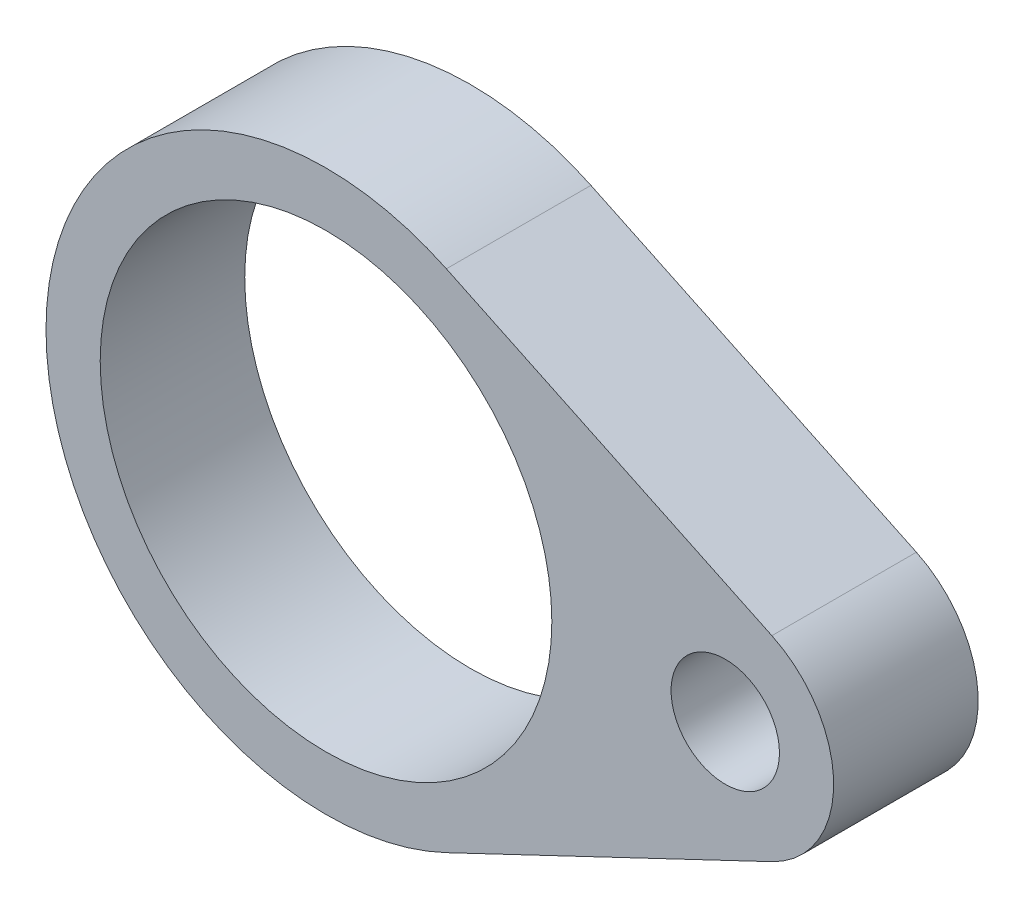
ISO-10303-21;
HEADER;
FILE_DESCRIPTION(('STEP AP214'),'2;1');
FILE_NAME('part.step','',(''),(''),'','','');
FILE_SCHEMA(('AUTOMOTIVE_DESIGN { 1 0 10303 214 1 1 1 1 }'));
ENDSEC;
DATA;
#1=APPLICATION_CONTEXT('core data for automotive mechanical design processes');
#2=APPLICATION_PROTOCOL_DEFINITION('international standard','automotive_design',2000,#1);
#3=PRODUCT_CONTEXT('',#1,'mechanical');
#4=PRODUCT('Part','Part','',(#3));
#5=PRODUCT_RELATED_PRODUCT_CATEGORY('part','',(#4));
#6=PRODUCT_DEFINITION_FORMATION('','',#4);
#7=PRODUCT_DEFINITION_CONTEXT('part definition',#1,'design');
#8=PRODUCT_DEFINITION('design','',#6,#7);
#9=PRODUCT_DEFINITION_SHAPE('','',#8);
#10=(LENGTH_UNIT() NAMED_UNIT(*) SI_UNIT(.MILLI.,.METRE.));
#11=(NAMED_UNIT(*) PLANE_ANGLE_UNIT() SI_UNIT($,.RADIAN.));
#12=(NAMED_UNIT(*) SI_UNIT($,.STERADIAN.) SOLID_ANGLE_UNIT());
#13=UNCERTAINTY_MEASURE_WITH_UNIT(LENGTH_MEASURE(1.E-05),#10,'distance_accuracy_value','');
#14=(GEOMETRIC_REPRESENTATION_CONTEXT(3) GLOBAL_UNCERTAINTY_ASSIGNED_CONTEXT((#13)) GLOBAL_UNIT_ASSIGNED_CONTEXT((#10,
#11,#12)) REPRESENTATION_CONTEXT('',''));
#15=CARTESIAN_POINT('',(0.,0.,0.));
#16=DIRECTION('',(0.,0.,1.));
#17=DIRECTION('',(1.,0.,0.));
#18=AXIS2_PLACEMENT_3D('',#15,#16,#17);
#19=CARTESIAN_POINT('',(0.,0.,8.));
#20=DIRECTION('',(0.,0.,1.));
#21=DIRECTION('',(1.,0.,0.));
#22=AXIS2_PLACEMENT_3D('',#19,#20,#21);
#23=PLANE('',#22);
#24=CARTESIAN_POINT('',(0.,0.,8.));
#25=DIRECTION('',(0.,0.,1.));
#26=DIRECTION('',(1.,0.,0.));
#27=AXIS2_PLACEMENT_3D('',#24,#25,#26);
#28=CIRCLE('',#27,12.5);
#29=CARTESIAN_POINT('',(12.5,0.,8.));
#30=VERTEX_POINT('',#29);
#31=EDGE_CURVE('E106',#30,#30,#28,.T.);
#32=ORIENTED_EDGE('',*,*,#31,.F.);
#33=EDGE_LOOP('',(#32));
#34=FACE_BOUND('',#33,.T.);
#35=CARTESIAN_POINT('',(0.,0.,8.));
#36=DIRECTION('',(0.,0.,1.));
#37=DIRECTION('',(1.,0.,0.));
#38=AXIS2_PLACEMENT_3D('',#35,#36,#37);
#39=CIRCLE('',#38,15.5);
#40=CARTESIAN_POINT('',(6.6628959276018,13.9948496904378,8.));
#41=VERTEX_POINT('',#40);
#42=CARTESIAN_POINT('',(6.66289592760181,-13.9948496904378,8.));
#43=VERTEX_POINT('',#42);
#44=EDGE_CURVE('E91',#41,#43,#39,.T.);
#45=ORIENTED_EDGE('',*,*,#44,.T.);
#46=DIRECTION('',(0.902893528415343,0.429864253393665,0.));
#47=VECTOR('',#46,1.);
#48=CARTESIAN_POINT('',(24.679185520362,-5.41736117049205,8.));
#49=LINE('',#48,#47);
#50=CARTESIAN_POINT('',(24.679185520362,-5.41736117049206,8.));
#51=VERTEX_POINT('',#50);
#52=EDGE_CURVE('E86',#43,#51,#49,.T.);
#53=ORIENTED_EDGE('',*,*,#52,.T.);
#54=CARTESIAN_POINT('',(22.1,0.,8.));
#55=DIRECTION('',(0.,0.,1.));
#56=DIRECTION('',(1.,0.,0.));
#57=AXIS2_PLACEMENT_3D('',#54,#55,#56);
#58=CIRCLE('',#57,6.);
#59=CARTESIAN_POINT('',(24.679185520362,5.41736117049206,8.));
#60=VERTEX_POINT('',#59);
#61=EDGE_CURVE('E89',#51,#60,#58,.T.);
#62=ORIENTED_EDGE('',*,*,#61,.T.);
#63=DIRECTION('',(-0.902893528415343,0.429864253393665,0.));
#64=VECTOR('',#63,1.);
#65=CARTESIAN_POINT('',(6.6628959276018,13.9948496904378,8.));
#66=LINE('',#65,#64);
#67=EDGE_CURVE('E56',#60,#41,#66,.T.);
#68=ORIENTED_EDGE('',*,*,#67,.T.);
#69=EDGE_LOOP('',(#45,#53,#62,#68));
#70=FACE_BOUND('',#69,.T.);
#71=CARTESIAN_POINT('',(22.1,0.,8.));
#72=DIRECTION('',(0.,0.,1.));
#73=DIRECTION('',(1.,0.,0.));
#74=AXIS2_PLACEMENT_3D('',#71,#72,#73);
#75=CIRCLE('',#74,3.);
#76=CARTESIAN_POINT('',(25.1,0.,8.));
#77=VERTEX_POINT('',#76);
#78=EDGE_CURVE('E121',#77,#77,#75,.T.);
#79=ORIENTED_EDGE('',*,*,#78,.F.);
#80=EDGE_LOOP('',(#79));
#81=FACE_BOUND('',#80,.T.);
#82=ADVANCED_FACE('F39',(#34,#70,#81),#23,.T.);
#83=CARTESIAN_POINT('',(0.,0.,0.));
#84=DIRECTION('',(0.,0.,1.));
#85=DIRECTION('',(1.,0.,0.));
#86=AXIS2_PLACEMENT_3D('',#83,#84,#85);
#87=PLANE('',#86);
#88=CARTESIAN_POINT('',(0.,0.,0.));
#89=DIRECTION('',(0.,0.,1.));
#90=DIRECTION('',(1.,0.,0.));
#91=AXIS2_PLACEMENT_3D('',#88,#89,#90);
#92=CIRCLE('',#91,12.5);
#93=CARTESIAN_POINT('',(12.5,0.,0.));
#94=VERTEX_POINT('',#93);
#95=EDGE_CURVE('E118',#94,#94,#92,.T.);
#96=ORIENTED_EDGE('',*,*,#95,.T.);
#97=EDGE_LOOP('',(#96));
#98=FACE_BOUND('',#97,.T.);
#99=CARTESIAN_POINT('',(0.,0.,0.));
#100=DIRECTION('',(0.,0.,1.));
#101=DIRECTION('',(1.,0.,0.));
#102=AXIS2_PLACEMENT_3D('',#99,#100,#101);
#103=CIRCLE('',#102,15.5);
#104=CARTESIAN_POINT('',(6.6628959276018,13.9948496904378,0.));
#105=VERTEX_POINT('',#104);
#106=CARTESIAN_POINT('',(6.66289592760181,-13.9948496904378,0.));
#107=VERTEX_POINT('',#106);
#108=EDGE_CURVE('E103',#105,#107,#103,.T.);
#109=ORIENTED_EDGE('',*,*,#108,.F.);
#110=DIRECTION('',(-0.902893528415343,0.429864253393665,0.));
#111=VECTOR('',#110,1.);
#112=CARTESIAN_POINT('',(6.6628959276018,13.9948496904378,0.));
#113=LINE('',#112,#111);
#114=CARTESIAN_POINT('',(24.679185520362,5.41736117049206,0.));
#115=VERTEX_POINT('',#114);
#116=EDGE_CURVE('E79',#115,#105,#113,.T.);
#117=ORIENTED_EDGE('',*,*,#116,.F.);
#118=CARTESIAN_POINT('',(22.1,0.,0.));
#119=DIRECTION('',(0.,0.,1.));
#120=DIRECTION('',(1.,0.,0.));
#121=AXIS2_PLACEMENT_3D('',#118,#119,#120);
#122=CIRCLE('',#121,6.);
#123=CARTESIAN_POINT('',(24.679185520362,-5.41736117049206,0.));
#124=VERTEX_POINT('',#123);
#125=EDGE_CURVE('E73',#124,#115,#122,.T.);
#126=ORIENTED_EDGE('',*,*,#125,.F.);
#127=DIRECTION('',(0.902893528415343,0.429864253393665,0.));
#128=VECTOR('',#127,1.);
#129=CARTESIAN_POINT('',(24.679185520362,-5.41736117049205,0.));
#130=LINE('',#129,#128);
#131=EDGE_CURVE('E95',#107,#124,#130,.T.);
#132=ORIENTED_EDGE('',*,*,#131,.F.);
#133=EDGE_LOOP('',(#109,#117,#126,#132));
#134=FACE_BOUND('',#133,.T.);
#135=CARTESIAN_POINT('',(22.1,0.,0.));
#136=DIRECTION('',(0.,0.,1.));
#137=DIRECTION('',(1.,0.,0.));
#138=AXIS2_PLACEMENT_3D('',#135,#136,#137);
#139=CIRCLE('',#138,3.);
#140=CARTESIAN_POINT('',(25.1,0.,0.));
#141=VERTEX_POINT('',#140);
#142=EDGE_CURVE('E124',#141,#141,#139,.T.);
#143=ORIENTED_EDGE('',*,*,#142,.T.);
#144=EDGE_LOOP('',(#143));
#145=FACE_BOUND('',#144,.T.);
#146=ADVANCED_FACE('F114',(#98,#134,#145),#87,.F.);
#147=CARTESIAN_POINT('',(0.,0.,8.));
#148=DIRECTION('',(0.,0.,-1.));
#149=DIRECTION('',(-1.,0.,0.));
#150=AXIS2_PLACEMENT_3D('',#147,#148,#149);
#151=CYLINDRICAL_SURFACE('',#150,15.5);
#152=ORIENTED_EDGE('',*,*,#108,.T.);
#153=DIRECTION('',(0.,0.,-1.));
#154=VECTOR('',#153,1.);
#155=CARTESIAN_POINT('',(6.66289592760181,-13.9948496904378,8.));
#156=LINE('',#155,#154);
#157=EDGE_CURVE('E11',#43,#107,#156,.T.);
#158=ORIENTED_EDGE('',*,*,#157,.F.);
#159=ORIENTED_EDGE('',*,*,#44,.F.);
#160=DIRECTION('',(0.,0.,-1.));
#161=VECTOR('',#160,1.);
#162=CARTESIAN_POINT('',(6.6628959276018,13.9948496904378,8.));
#163=LINE('',#162,#161);
#164=EDGE_CURVE('E99',#41,#105,#163,.T.);
#165=ORIENTED_EDGE('',*,*,#164,.T.);
#166=EDGE_LOOP('',(#152,#158,#159,#165));
#167=FACE_BOUND('',#166,.T.);
#168=ADVANCED_FACE('F41',(#167),#151,.T.);
#169=CARTESIAN_POINT('',(24.679185520362,-5.41736117049205,8.));
#170=DIRECTION('',(-0.429864253393665,0.902893528415343,0.));
#171=DIRECTION('',(-0.902893528415343,-0.429864253393665,0.));
#172=AXIS2_PLACEMENT_3D('',#169,#170,#171);
#173=PLANE('',#172);
#174=ORIENTED_EDGE('',*,*,#131,.T.);
#175=DIRECTION('',(0.,0.,-1.));
#176=VECTOR('',#175,1.);
#177=CARTESIAN_POINT('',(24.679185520362,-5.41736117049206,8.));
#178=LINE('',#177,#176);
#179=EDGE_CURVE('E48',#51,#124,#178,.T.);
#180=ORIENTED_EDGE('',*,*,#179,.F.);
#181=ORIENTED_EDGE('',*,*,#52,.F.);
#182=ORIENTED_EDGE('',*,*,#157,.T.);
#183=EDGE_LOOP('',(#174,#180,#181,#182));
#184=FACE_BOUND('',#183,.T.);
#185=ADVANCED_FACE('F94',(#184),#173,.F.);
#186=CARTESIAN_POINT('',(22.1,0.,8.));
#187=DIRECTION('',(0.,0.,-1.));
#188=DIRECTION('',(-1.,0.,0.));
#189=AXIS2_PLACEMENT_3D('',#186,#187,#188);
#190=CYLINDRICAL_SURFACE('',#189,6.);
#191=ORIENTED_EDGE('',*,*,#125,.T.);
#192=DIRECTION('',(0.,0.,-1.));
#193=VECTOR('',#192,1.);
#194=CARTESIAN_POINT('',(24.679185520362,5.41736117049206,8.));
#195=LINE('',#194,#193);
#196=EDGE_CURVE('E96',#60,#115,#195,.T.);
#197=ORIENTED_EDGE('',*,*,#196,.F.);
#198=ORIENTED_EDGE('',*,*,#61,.F.);
#199=ORIENTED_EDGE('',*,*,#179,.T.);
#200=EDGE_LOOP('',(#191,#197,#198,#199));
#201=FACE_BOUND('',#200,.T.);
#202=ADVANCED_FACE('F97',(#201),#190,.T.);
#203=CARTESIAN_POINT('',(6.6628959276018,13.9948496904378,8.));
#204=DIRECTION('',(-0.429864253393665,-0.902893528415343,0.));
#205=DIRECTION('',(0.902893528415343,-0.429864253393665,0.));
#206=AXIS2_PLACEMENT_3D('',#203,#204,#205);
#207=PLANE('',#206);
#208=ORIENTED_EDGE('',*,*,#116,.T.);
#209=ORIENTED_EDGE('',*,*,#164,.F.);
#210=ORIENTED_EDGE('',*,*,#67,.F.);
#211=ORIENTED_EDGE('',*,*,#196,.T.);
#212=EDGE_LOOP('',(#208,#209,#210,#211));
#213=FACE_BOUND('',#212,.T.);
#214=ADVANCED_FACE('F111',(#213),#207,.F.);
#215=CARTESIAN_POINT('',(0.,0.,8.));
#216=DIRECTION('',(0.,0.,-1.));
#217=DIRECTION('',(-1.,0.,0.));
#218=AXIS2_PLACEMENT_3D('',#215,#216,#217);
#219=CYLINDRICAL_SURFACE('',#218,12.5);
#220=ORIENTED_EDGE('',*,*,#31,.T.);
#221=EDGE_LOOP('',(#220));
#222=FACE_BOUND('',#221,.T.);
#223=ORIENTED_EDGE('',*,*,#95,.F.);
#224=EDGE_LOOP('',(#223));
#225=FACE_BOUND('',#224,.T.);
#226=ADVANCED_FACE('F142',(#222,#225),#219,.F.);
#227=CARTESIAN_POINT('',(22.1,0.,8.));
#228=DIRECTION('',(0.,0.,-1.));
#229=DIRECTION('',(-1.,0.,0.));
#230=AXIS2_PLACEMENT_3D('',#227,#228,#229);
#231=CYLINDRICAL_SURFACE('',#230,3.);
#232=ORIENTED_EDGE('',*,*,#78,.T.);
#233=EDGE_LOOP('',(#232));
#234=FACE_BOUND('',#233,.T.);
#235=ORIENTED_EDGE('',*,*,#142,.F.);
#236=EDGE_LOOP('',(#235));
#237=FACE_BOUND('',#236,.T.);
#238=ADVANCED_FACE('F130',(#234,#237),#231,.F.);
#239=CLOSED_SHELL('',(#82,#146,#168,#185,#202,#214,#226,#238));
#240=MANIFOLD_SOLID_BREP('B2',#239);
#241=ADVANCED_BREP_SHAPE_REPRESENTATION('',(#18,#240),#14);
#242=SHAPE_DEFINITION_REPRESENTATION(#9,#241);
ENDSEC;
END-ISO-10303-21;
